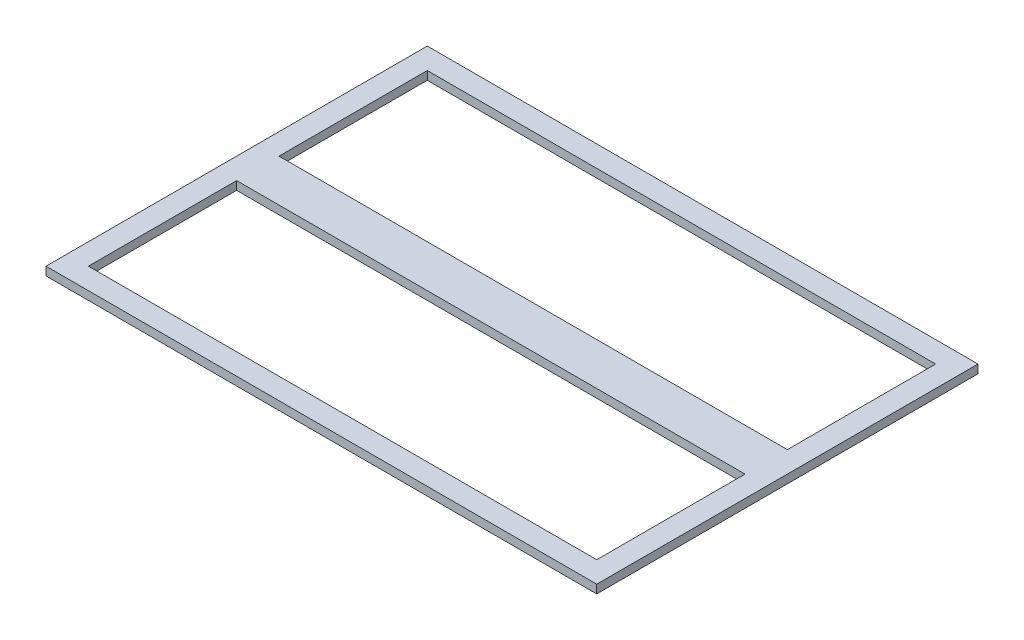
ISO-10303-21;
HEADER;
FILE_DESCRIPTION(('STEP AP214'),'2;1');
FILE_NAME('part.step','',(''),(''),'','','');
FILE_SCHEMA(('AUTOMOTIVE_DESIGN { 1 0 10303 214 1 1 1 1 }'));
ENDSEC;
DATA;
#1=APPLICATION_CONTEXT('core data for automotive mechanical design processes');
#2=APPLICATION_PROTOCOL_DEFINITION('international standard','automotive_design',2000,#1);
#3=PRODUCT_CONTEXT('',#1,'mechanical');
#4=PRODUCT('Part','Part','',(#3));
#5=PRODUCT_RELATED_PRODUCT_CATEGORY('part','',(#4));
#6=PRODUCT_DEFINITION_FORMATION('','',#4);
#7=PRODUCT_DEFINITION_CONTEXT('part definition',#1,'design');
#8=PRODUCT_DEFINITION('design','',#6,#7);
#9=PRODUCT_DEFINITION_SHAPE('','',#8);
#10=(LENGTH_UNIT() NAMED_UNIT(*) SI_UNIT(.MILLI.,.METRE.));
#11=(NAMED_UNIT(*) PLANE_ANGLE_UNIT() SI_UNIT($,.RADIAN.));
#12=(NAMED_UNIT(*) SI_UNIT($,.STERADIAN.) SOLID_ANGLE_UNIT());
#13=UNCERTAINTY_MEASURE_WITH_UNIT(LENGTH_MEASURE(1.E-05),#10,'distance_accuracy_value','');
#14=(GEOMETRIC_REPRESENTATION_CONTEXT(3) GLOBAL_UNCERTAINTY_ASSIGNED_CONTEXT((#13)) GLOBAL_UNIT_ASSIGNED_CONTEXT((#10,
#11,#12)) REPRESENTATION_CONTEXT('',''));
#15=CARTESIAN_POINT('',(0.,0.,0.));
#16=DIRECTION('',(0.,0.,1.));
#17=DIRECTION('',(1.,0.,0.));
#18=AXIS2_PLACEMENT_3D('',#15,#16,#17);
#19=CARTESIAN_POINT('',(76.2,2.54,0.));
#20=DIRECTION('',(-1.,0.,0.));
#21=DIRECTION('',(0.,0.,1.));
#22=AXIS2_PLACEMENT_3D('',#19,#20,#21);
#23=PLANE('',#22);
#24=DIRECTION('',(0.,0.,-1.));
#25=VECTOR('',#24,1.);
#26=CARTESIAN_POINT('',(76.2,0.,0.));
#27=LINE('',#26,#25);
#28=CARTESIAN_POINT('',(76.2,0.,50.8));
#29=VERTEX_POINT('',#28);
#30=CARTESIAN_POINT('',(76.2,0.,6.35));
#31=VERTEX_POINT('',#30);
#32=EDGE_CURVE('E188',#29,#31,#27,.T.);
#33=ORIENTED_EDGE('',*,*,#32,.F.);
#34=DIRECTION('',(0.,-1.,0.));
#35=VECTOR('',#34,1.);
#36=CARTESIAN_POINT('',(76.2,2.54,50.8));
#37=LINE('',#36,#35);
#38=CARTESIAN_POINT('',(76.2,2.54,50.8));
#39=VERTEX_POINT('',#38);
#40=EDGE_CURVE('E11',#39,#29,#37,.T.);
#41=ORIENTED_EDGE('',*,*,#40,.F.);
#42=DIRECTION('',(0.,0.,-1.));
#43=VECTOR('',#42,1.);
#44=CARTESIAN_POINT('',(76.2,2.54,0.));
#45=LINE('',#44,#43);
#46=CARTESIAN_POINT('',(76.2,2.54,6.35));
#47=VERTEX_POINT('',#46);
#48=EDGE_CURVE('E147',#39,#47,#45,.T.);
#49=ORIENTED_EDGE('',*,*,#48,.T.);
#50=DIRECTION('',(0.,-1.,0.));
#51=VECTOR('',#50,1.);
#52=CARTESIAN_POINT('',(76.2,2.54,6.35));
#53=LINE('',#52,#51);
#54=EDGE_CURVE('E100',#47,#31,#53,.T.);
#55=ORIENTED_EDGE('',*,*,#54,.T.);
#56=EDGE_LOOP('',(#33,#41,#49,#55));
#57=FACE_BOUND('',#56,.T.);
#58=ADVANCED_FACE('F35',(#57),#23,.T.);
#59=CARTESIAN_POINT('',(-156.330769584598,2.54,50.8));
#60=DIRECTION('',(0.,0.,1.));
#61=DIRECTION('',(1.,0.,0.));
#62=AXIS2_PLACEMENT_3D('',#59,#60,#61);
#63=PLANE('',#62);
#64=DIRECTION('',(-1.,0.,0.));
#65=VECTOR('',#64,1.);
#66=CARTESIAN_POINT('',(-156.330769584598,0.,50.8));
#67=LINE('',#66,#65);
#68=CARTESIAN_POINT('',(-76.2,0.,50.8));
#69=VERTEX_POINT('',#68);
#70=EDGE_CURVE('E152',#29,#69,#67,.T.);
#71=ORIENTED_EDGE('',*,*,#70,.T.);
#72=DIRECTION('',(0.,-1.,0.));
#73=VECTOR('',#72,1.);
#74=CARTESIAN_POINT('',(-76.2,2.54,50.8));
#75=LINE('',#74,#73);
#76=CARTESIAN_POINT('',(-76.2,2.54,50.8));
#77=VERTEX_POINT('',#76);
#78=EDGE_CURVE('E45',#77,#69,#75,.T.);
#79=ORIENTED_EDGE('',*,*,#78,.F.);
#80=DIRECTION('',(-1.,0.,0.));
#81=VECTOR('',#80,1.);
#82=CARTESIAN_POINT('',(-156.330769584598,2.54,50.8));
#83=LINE('',#82,#81);
#84=EDGE_CURVE('E142',#39,#77,#83,.T.);
#85=ORIENTED_EDGE('',*,*,#84,.F.);
#86=ORIENTED_EDGE('',*,*,#40,.T.);
#87=EDGE_LOOP('',(#71,#79,#85,#86));
#88=FACE_BOUND('',#87,.T.);
#89=ADVANCED_FACE('F150',(#88),#63,.F.);
#90=CARTESIAN_POINT('',(-76.2,2.54,0.));
#91=DIRECTION('',(-1.,0.,0.));
#92=DIRECTION('',(0.,0.,1.));
#93=AXIS2_PLACEMENT_3D('',#90,#91,#92);
#94=PLANE('',#93);
#95=DIRECTION('',(0.,0.,-1.));
#96=VECTOR('',#95,1.);
#97=CARTESIAN_POINT('',(-76.2,0.,0.));
#98=LINE('',#97,#96);
#99=CARTESIAN_POINT('',(-76.2,0.,6.35));
#100=VERTEX_POINT('',#99);
#101=EDGE_CURVE('E195',#69,#100,#98,.T.);
#102=ORIENTED_EDGE('',*,*,#101,.T.);
#103=DIRECTION('',(0.,-1.,0.));
#104=VECTOR('',#103,1.);
#105=CARTESIAN_POINT('',(-76.2,2.54,6.35));
#106=LINE('',#105,#104);
#107=CARTESIAN_POINT('',(-76.2,2.54,6.35));
#108=VERTEX_POINT('',#107);
#109=EDGE_CURVE('E141',#108,#100,#106,.T.);
#110=ORIENTED_EDGE('',*,*,#109,.F.);
#111=DIRECTION('',(0.,0.,-1.));
#112=VECTOR('',#111,1.);
#113=CARTESIAN_POINT('',(-76.2,2.54,0.));
#114=LINE('',#113,#112);
#115=EDGE_CURVE('E135',#77,#108,#114,.T.);
#116=ORIENTED_EDGE('',*,*,#115,.F.);
#117=ORIENTED_EDGE('',*,*,#78,.T.);
#118=EDGE_LOOP('',(#102,#110,#116,#117));
#119=FACE_BOUND('',#118,.T.);
#120=ADVANCED_FACE('F138',(#119),#94,.F.);
#121=CARTESIAN_POINT('',(-82.55,2.54,0.));
#122=DIRECTION('',(-1.,0.,0.));
#123=DIRECTION('',(0.,0.,1.));
#124=AXIS2_PLACEMENT_3D('',#121,#122,#123);
#125=PLANE('',#124);
#126=DIRECTION('',(0.,0.,-1.));
#127=VECTOR('',#126,1.);
#128=CARTESIAN_POINT('',(-82.55,0.,0.));
#129=LINE('',#128,#127);
#130=CARTESIAN_POINT('',(-82.55,0.,57.15));
#131=VERTEX_POINT('',#130);
#132=CARTESIAN_POINT('',(-82.55,0.,-57.15));
#133=VERTEX_POINT('',#132);
#134=EDGE_CURVE('E199',#131,#133,#129,.T.);
#135=ORIENTED_EDGE('',*,*,#134,.F.);
#136=DIRECTION('',(0.,-1.,0.));
#137=VECTOR('',#136,1.);
#138=CARTESIAN_POINT('',(-82.55,2.54,57.15));
#139=LINE('',#138,#137);
#140=CARTESIAN_POINT('',(-82.55,2.54,57.15));
#141=VERTEX_POINT('',#140);
#142=EDGE_CURVE('E164',#141,#131,#139,.T.);
#143=ORIENTED_EDGE('',*,*,#142,.F.);
#144=DIRECTION('',(0.,0.,-1.));
#145=VECTOR('',#144,1.);
#146=CARTESIAN_POINT('',(-82.55,2.54,0.));
#147=LINE('',#146,#145);
#148=CARTESIAN_POINT('',(-82.55,2.54,-57.15));
#149=VERTEX_POINT('',#148);
#150=EDGE_CURVE('E223',#141,#149,#147,.T.);
#151=ORIENTED_EDGE('',*,*,#150,.T.);
#152=DIRECTION('',(0.,-1.,0.));
#153=VECTOR('',#152,1.);
#154=CARTESIAN_POINT('',(-82.55,2.54,-57.15));
#155=LINE('',#154,#153);
#156=EDGE_CURVE('E157',#149,#133,#155,.T.);
#157=ORIENTED_EDGE('',*,*,#156,.T.);
#158=EDGE_LOOP('',(#135,#143,#151,#157));
#159=FACE_BOUND('',#158,.T.);
#160=ADVANCED_FACE('F243',(#159),#125,.T.);
#161=CARTESIAN_POINT('',(-156.330769584598,2.54,57.15));
#162=DIRECTION('',(0.,0.,1.));
#163=DIRECTION('',(1.,0.,0.));
#164=AXIS2_PLACEMENT_3D('',#161,#162,#163);
#165=PLANE('',#164);
#166=DIRECTION('',(-1.,0.,0.));
#167=VECTOR('',#166,1.);
#168=CARTESIAN_POINT('',(-156.330769584598,0.,57.15));
#169=LINE('',#168,#167);
#170=CARTESIAN_POINT('',(82.55,0.,57.15));
#171=VERTEX_POINT('',#170);
#172=EDGE_CURVE('E202',#171,#131,#169,.T.);
#173=ORIENTED_EDGE('',*,*,#172,.F.);
#174=DIRECTION('',(0.,-1.,0.));
#175=VECTOR('',#174,1.);
#176=CARTESIAN_POINT('',(82.55,2.54,57.15));
#177=LINE('',#176,#175);
#178=CARTESIAN_POINT('',(82.55,2.54,57.15));
#179=VERTEX_POINT('',#178);
#180=EDGE_CURVE('E162',#179,#171,#177,.T.);
#181=ORIENTED_EDGE('',*,*,#180,.F.);
#182=DIRECTION('',(-1.,0.,0.));
#183=VECTOR('',#182,1.);
#184=CARTESIAN_POINT('',(-156.330769584598,2.54,57.15));
#185=LINE('',#184,#183);
#186=EDGE_CURVE('E226',#179,#141,#185,.T.);
#187=ORIENTED_EDGE('',*,*,#186,.T.);
#188=ORIENTED_EDGE('',*,*,#142,.T.);
#189=EDGE_LOOP('',(#173,#181,#187,#188));
#190=FACE_BOUND('',#189,.T.);
#191=ADVANCED_FACE('F246',(#190),#165,.T.);
#192=CARTESIAN_POINT('',(82.55,2.54,0.));
#193=DIRECTION('',(-1.,0.,0.));
#194=DIRECTION('',(0.,0.,1.));
#195=AXIS2_PLACEMENT_3D('',#192,#193,#194);
#196=PLANE('',#195);
#197=DIRECTION('',(0.,0.,-1.));
#198=VECTOR('',#197,1.);
#199=CARTESIAN_POINT('',(82.55,0.,0.));
#200=LINE('',#199,#198);
#201=CARTESIAN_POINT('',(82.55,0.,-57.15));
#202=VERTEX_POINT('',#201);
#203=EDGE_CURVE('E205',#171,#202,#200,.T.);
#204=ORIENTED_EDGE('',*,*,#203,.T.);
#205=DIRECTION('',(0.,-1.,0.));
#206=VECTOR('',#205,1.);
#207=CARTESIAN_POINT('',(82.55,2.54,-57.15));
#208=LINE('',#207,#206);
#209=CARTESIAN_POINT('',(82.55,2.54,-57.15));
#210=VERTEX_POINT('',#209);
#211=EDGE_CURVE('E159',#210,#202,#208,.T.);
#212=ORIENTED_EDGE('',*,*,#211,.F.);
#213=DIRECTION('',(0.,0.,-1.));
#214=VECTOR('',#213,1.);
#215=CARTESIAN_POINT('',(82.55,2.54,0.));
#216=LINE('',#215,#214);
#217=EDGE_CURVE('E216',#179,#210,#216,.T.);
#218=ORIENTED_EDGE('',*,*,#217,.F.);
#219=ORIENTED_EDGE('',*,*,#180,.T.);
#220=EDGE_LOOP('',(#204,#212,#218,#219));
#221=FACE_BOUND('',#220,.T.);
#222=ADVANCED_FACE('F237',(#221),#196,.F.);
#223=CARTESIAN_POINT('',(76.2,0.,-6.35));
#224=VERTEX_POINT('',#223);
#225=CARTESIAN_POINT('',(76.2,0.,-50.8));
#226=VERTEX_POINT('',#225);
#227=EDGE_CURVE('E182',#224,#226,#27,.T.);
#228=ORIENTED_EDGE('',*,*,#227,.F.);
#229=DIRECTION('',(0.,-1.,0.));
#230=VECTOR('',#229,1.);
#231=CARTESIAN_POINT('',(76.2,2.54,-6.35));
#232=LINE('',#231,#230);
#233=CARTESIAN_POINT('',(76.2,2.54,-6.35));
#234=VERTEX_POINT('',#233);
#235=EDGE_CURVE('E39',#234,#224,#232,.T.);
#236=ORIENTED_EDGE('',*,*,#235,.F.);
#237=CARTESIAN_POINT('',(76.2,2.54,-50.8));
#238=VERTEX_POINT('',#237);
#239=EDGE_CURVE('E212',#234,#238,#45,.T.);
#240=ORIENTED_EDGE('',*,*,#239,.T.);
#241=DIRECTION('',(0.,-1.,0.));
#242=VECTOR('',#241,1.);
#243=CARTESIAN_POINT('',(76.2,2.54,-50.8));
#244=LINE('',#243,#242);
#245=EDGE_CURVE('E166',#238,#226,#244,.T.);
#246=ORIENTED_EDGE('',*,*,#245,.T.);
#247=EDGE_LOOP('',(#228,#236,#240,#246));
#248=FACE_BOUND('',#247,.T.);
#249=ADVANCED_FACE('F183',(#248),#23,.T.);
#250=CARTESIAN_POINT('',(-156.330769584598,2.54,-6.35));
#251=DIRECTION('',(0.,0.,-1.));
#252=DIRECTION('',(-1.,0.,0.));
#253=AXIS2_PLACEMENT_3D('',#250,#251,#252);
#254=PLANE('',#253);
#255=DIRECTION('',(1.,0.,0.));
#256=VECTOR('',#255,1.);
#257=CARTESIAN_POINT('',(-156.330769584598,0.,-6.35));
#258=LINE('',#257,#256);
#259=CARTESIAN_POINT('',(-76.2,0.,-6.35));
#260=VERTEX_POINT('',#259);
#261=EDGE_CURVE('E178',#260,#224,#258,.T.);
#262=ORIENTED_EDGE('',*,*,#261,.F.);
#263=DIRECTION('',(0.,-1.,0.));
#264=VECTOR('',#263,1.);
#265=CARTESIAN_POINT('',(-76.2,2.54,-6.35));
#266=LINE('',#265,#264);
#267=CARTESIAN_POINT('',(-76.2,2.54,-6.35));
#268=VERTEX_POINT('',#267);
#269=EDGE_CURVE('E169',#268,#260,#266,.T.);
#270=ORIENTED_EDGE('',*,*,#269,.F.);
#271=DIRECTION('',(1.,0.,0.));
#272=VECTOR('',#271,1.);
#273=CARTESIAN_POINT('',(-156.330769584598,2.54,-6.35));
#274=LINE('',#273,#272);
#275=EDGE_CURVE('E180',#268,#234,#274,.T.);
#276=ORIENTED_EDGE('',*,*,#275,.T.);
#277=ORIENTED_EDGE('',*,*,#235,.T.);
#278=EDGE_LOOP('',(#262,#270,#276,#277));
#279=FACE_BOUND('',#278,.T.);
#280=ADVANCED_FACE('F37',(#279),#254,.T.);
#281=CARTESIAN_POINT('',(-76.2,0.,-50.8));
#282=VERTEX_POINT('',#281);
#283=EDGE_CURVE('E191',#260,#282,#98,.T.);
#284=ORIENTED_EDGE('',*,*,#283,.T.);
#285=DIRECTION('',(0.,-1.,0.));
#286=VECTOR('',#285,1.);
#287=CARTESIAN_POINT('',(-76.2,2.54,-50.8));
#288=LINE('',#287,#286);
#289=CARTESIAN_POINT('',(-76.2,2.54,-50.8));
#290=VERTEX_POINT('',#289);
#291=EDGE_CURVE('E168',#290,#282,#288,.T.);
#292=ORIENTED_EDGE('',*,*,#291,.F.);
#293=EDGE_CURVE('E144',#268,#290,#114,.T.);
#294=ORIENTED_EDGE('',*,*,#293,.F.);
#295=ORIENTED_EDGE('',*,*,#269,.T.);
#296=EDGE_LOOP('',(#284,#292,#294,#295));
#297=FACE_BOUND('',#296,.T.);
#298=ADVANCED_FACE('F268',(#297),#94,.F.);
#299=CARTESIAN_POINT('',(-156.330769584598,2.54,-57.15));
#300=DIRECTION('',(0.,0.,1.));
#301=DIRECTION('',(1.,0.,0.));
#302=AXIS2_PLACEMENT_3D('',#299,#300,#301);
#303=PLANE('',#302);
#304=DIRECTION('',(-1.,0.,0.));
#305=VECTOR('',#304,1.);
#306=CARTESIAN_POINT('',(-156.330769584598,0.,-57.15));
#307=LINE('',#306,#305);
#308=EDGE_CURVE('E208',#202,#133,#307,.T.);
#309=ORIENTED_EDGE('',*,*,#308,.T.);
#310=ORIENTED_EDGE('',*,*,#156,.F.);
#311=DIRECTION('',(-1.,0.,0.));
#312=VECTOR('',#311,1.);
#313=CARTESIAN_POINT('',(-156.330769584598,2.54,-57.15));
#314=LINE('',#313,#312);
#315=EDGE_CURVE('E215',#210,#149,#314,.T.);
#316=ORIENTED_EDGE('',*,*,#315,.F.);
#317=ORIENTED_EDGE('',*,*,#211,.T.);
#318=EDGE_LOOP('',(#309,#310,#316,#317));
#319=FACE_BOUND('',#318,.T.);
#320=ADVANCED_FACE('F240',(#319),#303,.F.);
#321=CARTESIAN_POINT('',(-156.330769584598,2.54,-50.8));
#322=DIRECTION('',(0.,0.,1.));
#323=DIRECTION('',(1.,0.,0.));
#324=AXIS2_PLACEMENT_3D('',#321,#322,#323);
#325=PLANE('',#324);
#326=DIRECTION('',(-1.,0.,0.));
#327=VECTOR('',#326,1.);
#328=CARTESIAN_POINT('',(-156.330769584598,0.,-50.8));
#329=LINE('',#328,#327);
#330=EDGE_CURVE('E193',#226,#282,#329,.T.);
#331=ORIENTED_EDGE('',*,*,#330,.F.);
#332=ORIENTED_EDGE('',*,*,#245,.F.);
#333=DIRECTION('',(-1.,0.,0.));
#334=VECTOR('',#333,1.);
#335=CARTESIAN_POINT('',(-156.330769584598,2.54,-50.8));
#336=LINE('',#335,#334);
#337=EDGE_CURVE('E220',#238,#290,#336,.T.);
#338=ORIENTED_EDGE('',*,*,#337,.T.);
#339=ORIENTED_EDGE('',*,*,#291,.T.);
#340=EDGE_LOOP('',(#331,#332,#338,#339));
#341=FACE_BOUND('',#340,.T.);
#342=ADVANCED_FACE('F276',(#341),#325,.T.);
#343=CARTESIAN_POINT('',(-156.330769584598,2.54,6.35));
#344=DIRECTION('',(0.,0.,-1.));
#345=DIRECTION('',(-1.,0.,0.));
#346=AXIS2_PLACEMENT_3D('',#343,#344,#345);
#347=PLANE('',#346);
#348=DIRECTION('',(1.,0.,0.));
#349=VECTOR('',#348,1.);
#350=CARTESIAN_POINT('',(-156.330769584598,0.,6.35));
#351=LINE('',#350,#349);
#352=EDGE_CURVE('E93',#100,#31,#351,.T.);
#353=ORIENTED_EDGE('',*,*,#352,.T.);
#354=ORIENTED_EDGE('',*,*,#54,.F.);
#355=DIRECTION('',(1.,0.,0.));
#356=VECTOR('',#355,1.);
#357=CARTESIAN_POINT('',(-156.330769584598,2.54,6.35));
#358=LINE('',#357,#356);
#359=EDGE_CURVE('E54',#108,#47,#358,.T.);
#360=ORIENTED_EDGE('',*,*,#359,.F.);
#361=ORIENTED_EDGE('',*,*,#109,.T.);
#362=EDGE_LOOP('',(#353,#354,#360,#361));
#363=FACE_BOUND('',#362,.T.);
#364=ADVANCED_FACE('F252',(#363),#347,.F.);
#365=CARTESIAN_POINT('',(-156.330769584598,2.54,0.));
#366=DIRECTION('',(0.,1.,0.));
#367=DIRECTION('',(0.,0.,1.));
#368=AXIS2_PLACEMENT_3D('',#365,#366,#367);
#369=PLANE('',#368);
#370=ORIENTED_EDGE('',*,*,#239,.F.);
#371=ORIENTED_EDGE('',*,*,#275,.F.);
#372=ORIENTED_EDGE('',*,*,#293,.T.);
#373=ORIENTED_EDGE('',*,*,#337,.F.);
#374=EDGE_LOOP('',(#370,#371,#372,#373));
#375=FACE_BOUND('',#374,.T.);
#376=ORIENTED_EDGE('',*,*,#150,.F.);
#377=ORIENTED_EDGE('',*,*,#186,.F.);
#378=ORIENTED_EDGE('',*,*,#217,.T.);
#379=ORIENTED_EDGE('',*,*,#315,.T.);
#380=EDGE_LOOP('',(#376,#377,#378,#379));
#381=FACE_BOUND('',#380,.T.);
#382=ORIENTED_EDGE('',*,*,#48,.F.);
#383=ORIENTED_EDGE('',*,*,#84,.T.);
#384=ORIENTED_EDGE('',*,*,#115,.T.);
#385=ORIENTED_EDGE('',*,*,#359,.T.);
#386=EDGE_LOOP('',(#382,#383,#384,#385));
#387=FACE_BOUND('',#386,.T.);
#388=ADVANCED_FACE('F146',(#375,#381,#387),#369,.T.);
#389=CARTESIAN_POINT('',(-156.330769584598,0.,0.));
#390=DIRECTION('',(0.,1.,0.));
#391=DIRECTION('',(0.,0.,1.));
#392=AXIS2_PLACEMENT_3D('',#389,#390,#391);
#393=PLANE('',#392);
#394=ORIENTED_EDGE('',*,*,#227,.T.);
#395=ORIENTED_EDGE('',*,*,#330,.T.);
#396=ORIENTED_EDGE('',*,*,#283,.F.);
#397=ORIENTED_EDGE('',*,*,#261,.T.);
#398=EDGE_LOOP('',(#394,#395,#396,#397));
#399=FACE_BOUND('',#398,.T.);
#400=ORIENTED_EDGE('',*,*,#134,.T.);
#401=ORIENTED_EDGE('',*,*,#308,.F.);
#402=ORIENTED_EDGE('',*,*,#203,.F.);
#403=ORIENTED_EDGE('',*,*,#172,.T.);
#404=EDGE_LOOP('',(#400,#401,#402,#403));
#405=FACE_BOUND('',#404,.T.);
#406=ORIENTED_EDGE('',*,*,#32,.T.);
#407=ORIENTED_EDGE('',*,*,#352,.F.);
#408=ORIENTED_EDGE('',*,*,#101,.F.);
#409=ORIENTED_EDGE('',*,*,#70,.F.);
#410=EDGE_LOOP('',(#406,#407,#408,#409));
#411=FACE_BOUND('',#410,.T.);
#412=ADVANCED_FACE('F189',(#399,#405,#411),#393,.F.);
#413=CLOSED_SHELL('',(#58,#89,#120,#160,#191,#222,#249,#280,#298,#320,#342,#364,#388,#412));
#414=MANIFOLD_SOLID_BREP('B2',#413);
#415=ADVANCED_BREP_SHAPE_REPRESENTATION('',(#18,#414),#14);
#416=SHAPE_DEFINITION_REPRESENTATION(#9,#415);
ENDSEC;
END-ISO-10303-21;
